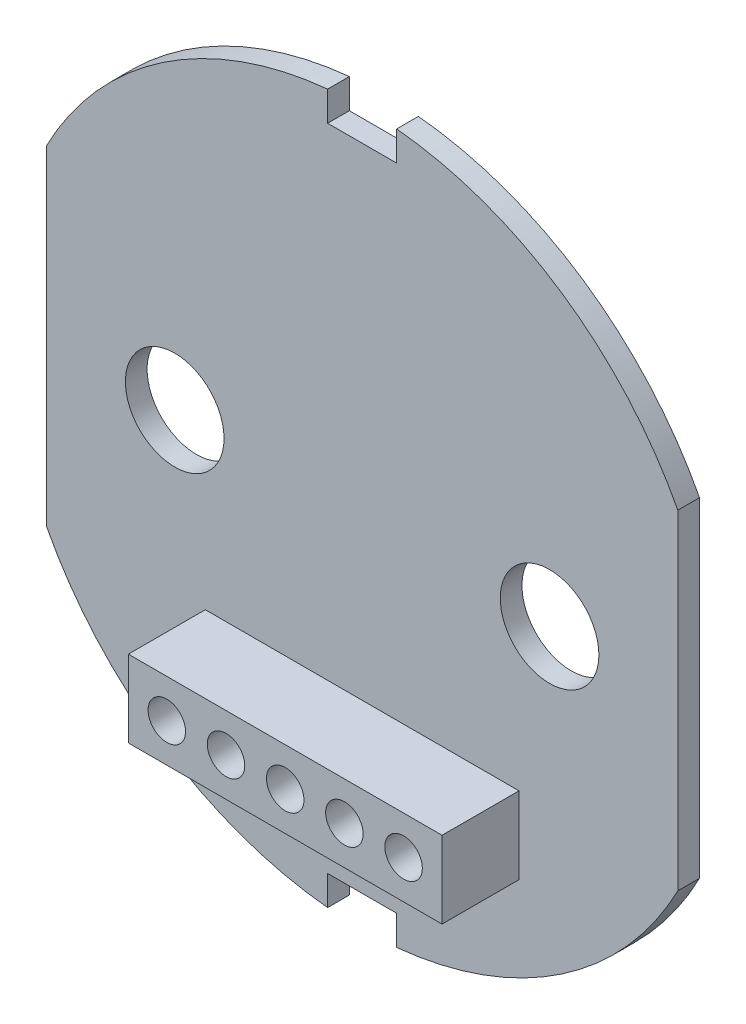
ISO-10303-21;
HEADER;
FILE_DESCRIPTION(('STEP AP214'),'2;1');
FILE_NAME('part.step','',(''),(''),'','','');
FILE_SCHEMA(('AUTOMOTIVE_DESIGN { 1 0 10303 214 1 1 1 1 }'));
ENDSEC;
DATA;
#1=APPLICATION_CONTEXT('core data for automotive mechanical design processes');
#2=APPLICATION_PROTOCOL_DEFINITION('international standard','automotive_design',2000,#1);
#3=PRODUCT_CONTEXT('',#1,'mechanical');
#4=PRODUCT('Part','Part','',(#3));
#5=PRODUCT_RELATED_PRODUCT_CATEGORY('part','',(#4));
#6=PRODUCT_DEFINITION_FORMATION('','',#4);
#7=PRODUCT_DEFINITION_CONTEXT('part definition',#1,'design');
#8=PRODUCT_DEFINITION('design','',#6,#7);
#9=PRODUCT_DEFINITION_SHAPE('','',#8);
#10=(LENGTH_UNIT() NAMED_UNIT(*) SI_UNIT(.MILLI.,.METRE.));
#11=(NAMED_UNIT(*) PLANE_ANGLE_UNIT() SI_UNIT($,.RADIAN.));
#12=(NAMED_UNIT(*) SI_UNIT($,.STERADIAN.) SOLID_ANGLE_UNIT());
#13=UNCERTAINTY_MEASURE_WITH_UNIT(LENGTH_MEASURE(1.E-05),#10,'distance_accuracy_value','');
#14=(GEOMETRIC_REPRESENTATION_CONTEXT(3) GLOBAL_UNCERTAINTY_ASSIGNED_CONTEXT((#13)) GLOBAL_UNIT_ASSIGNED_CONTEXT((#10,
#11,#12)) REPRESENTATION_CONTEXT('',''));
#15=CARTESIAN_POINT('',(0.,0.,0.));
#16=DIRECTION('',(0.,0.,1.));
#17=DIRECTION('',(1.,0.,0.));
#18=AXIS2_PLACEMENT_3D('',#15,#16,#17);
#19=CARTESIAN_POINT('',(0.,0.,1.1));
#20=DIRECTION('',(0.,0.,1.));
#21=DIRECTION('',(1.,0.,0.));
#22=AXIS2_PLACEMENT_3D('',#19,#20,#21);
#23=PLANE('',#22);
#24=DIRECTION('',(0.,-1.,0.));
#25=VECTOR('',#24,1.);
#26=CARTESIAN_POINT('',(-1.75,0.,1.1));
#27=LINE('',#26,#25);
#28=CARTESIAN_POINT('',(-1.75,17.9649659058958,1.1));
#29=VERTEX_POINT('',#28);
#30=CARTESIAN_POINT('',(-1.75,16.4649659058958,1.1));
#31=VERTEX_POINT('',#30);
#32=EDGE_CURVE('E309',#29,#31,#27,.T.);
#33=ORIENTED_EDGE('',*,*,#32,.F.);
#34=CARTESIAN_POINT('',(0.,0.,1.1));
#35=DIRECTION('',(0.,0.,1.));
#36=DIRECTION('',(1.,0.,0.));
#37=AXIS2_PLACEMENT_3D('',#34,#35,#36);
#38=CIRCLE('',#37,18.05);
#39=CARTESIAN_POINT('',(-16.,8.3547890458108,1.1));
#40=VERTEX_POINT('',#39);
#41=EDGE_CURVE('E311',#29,#40,#38,.T.);
#42=ORIENTED_EDGE('',*,*,#41,.T.);
#43=DIRECTION('',(0.,-1.,0.));
#44=VECTOR('',#43,1.);
#45=CARTESIAN_POINT('',(-16.,0.,1.1));
#46=LINE('',#45,#44);
#47=CARTESIAN_POINT('',(-16.,-8.35478904581079,1.1));
#48=VERTEX_POINT('',#47);
#49=EDGE_CURVE('E188',#40,#48,#46,.T.);
#50=ORIENTED_EDGE('',*,*,#49,.T.);
#51=CARTESIAN_POINT('',(0.,0.,1.1));
#52=DIRECTION('',(0.,0.,1.));
#53=DIRECTION('',(1.,0.,0.));
#54=AXIS2_PLACEMENT_3D('',#51,#52,#53);
#55=CIRCLE('',#54,18.05);
#56=CARTESIAN_POINT('',(-1.75,-17.9649659058958,1.1));
#57=VERTEX_POINT('',#56);
#58=EDGE_CURVE('E314',#48,#57,#55,.T.);
#59=ORIENTED_EDGE('',*,*,#58,.T.);
#60=DIRECTION('',(0.,1.,0.));
#61=VECTOR('',#60,1.);
#62=CARTESIAN_POINT('',(-1.75,0.,1.1));
#63=LINE('',#62,#61);
#64=CARTESIAN_POINT('',(-1.75,-16.4649659058958,1.1));
#65=VERTEX_POINT('',#64);
#66=EDGE_CURVE('E317',#57,#65,#63,.T.);
#67=ORIENTED_EDGE('',*,*,#66,.T.);
#68=DIRECTION('',(1.,0.,0.));
#69=VECTOR('',#68,1.);
#70=CARTESIAN_POINT('',(0.,-16.4649659058958,1.1));
#71=LINE('',#70,#69);
#72=CARTESIAN_POINT('',(1.75,-16.4649659058958,1.1));
#73=VERTEX_POINT('',#72);
#74=EDGE_CURVE('E320',#65,#73,#71,.T.);
#75=ORIENTED_EDGE('',*,*,#74,.T.);
#76=DIRECTION('',(0.,1.,0.));
#77=VECTOR('',#76,1.);
#78=CARTESIAN_POINT('',(1.75,0.,1.1));
#79=LINE('',#78,#77);
#80=CARTESIAN_POINT('',(1.75,-17.9649659058958,1.1));
#81=VERTEX_POINT('',#80);
#82=EDGE_CURVE('E322',#81,#73,#79,.T.);
#83=ORIENTED_EDGE('',*,*,#82,.F.);
#84=CARTESIAN_POINT('',(0.,0.,1.1));
#85=DIRECTION('',(0.,0.,1.));
#86=DIRECTION('',(1.,0.,0.));
#87=AXIS2_PLACEMENT_3D('',#84,#85,#86);
#88=CIRCLE('',#87,18.05);
#89=CARTESIAN_POINT('',(16.,-8.35478904581079,1.1));
#90=VERTEX_POINT('',#89);
#91=EDGE_CURVE('E325',#81,#90,#88,.T.);
#92=ORIENTED_EDGE('',*,*,#91,.T.);
#93=DIRECTION('',(0.,-1.,0.));
#94=VECTOR('',#93,1.);
#95=CARTESIAN_POINT('',(16.,0.,1.1));
#96=LINE('',#95,#94);
#97=CARTESIAN_POINT('',(16.,8.35478904581079,1.1));
#98=VERTEX_POINT('',#97);
#99=EDGE_CURVE('E153',#98,#90,#96,.T.);
#100=ORIENTED_EDGE('',*,*,#99,.F.);
#101=CARTESIAN_POINT('',(0.,0.,1.1));
#102=DIRECTION('',(0.,0.,1.));
#103=DIRECTION('',(1.,0.,0.));
#104=AXIS2_PLACEMENT_3D('',#101,#102,#103);
#105=CIRCLE('',#104,18.05);
#106=CARTESIAN_POINT('',(1.75,17.9649659058958,1.1));
#107=VERTEX_POINT('',#106);
#108=EDGE_CURVE('E146',#98,#107,#105,.T.);
#109=ORIENTED_EDGE('',*,*,#108,.T.);
#110=DIRECTION('',(0.,-1.,0.));
#111=VECTOR('',#110,1.);
#112=CARTESIAN_POINT('',(1.75,0.,1.1));
#113=LINE('',#112,#111);
#114=CARTESIAN_POINT('',(1.75,16.4649659058958,1.1));
#115=VERTEX_POINT('',#114);
#116=EDGE_CURVE('E135',#107,#115,#113,.T.);
#117=ORIENTED_EDGE('',*,*,#116,.T.);
#118=DIRECTION('',(1.,0.,0.));
#119=VECTOR('',#118,1.);
#120=CARTESIAN_POINT('',(0.,16.4649659058958,1.1));
#121=LINE('',#120,#119);
#122=EDGE_CURVE('E145',#31,#115,#121,.T.);
#123=ORIENTED_EDGE('',*,*,#122,.F.);
#124=EDGE_LOOP('',(#33,#42,#50,#59,#67,#75,#83,#92,#100,#109,#117,#123));
#125=FACE_BOUND('',#124,.T.);
#126=CARTESIAN_POINT('',(-9.5,0.,1.1));
#127=DIRECTION('',(0.,0.,1.));
#128=DIRECTION('',(1.,0.,0.));
#129=AXIS2_PLACEMENT_3D('',#126,#127,#128);
#130=CIRCLE('',#129,2.5);
#131=CARTESIAN_POINT('',(-7.,0.,1.1));
#132=VERTEX_POINT('',#131);
#133=EDGE_CURVE('E306',#132,#132,#130,.T.);
#134=ORIENTED_EDGE('',*,*,#133,.F.);
#135=EDGE_LOOP('',(#134));
#136=FACE_BOUND('',#135,.T.);
#137=CARTESIAN_POINT('',(9.5,0.,1.1));
#138=DIRECTION('',(0.,0.,1.));
#139=DIRECTION('',(1.,0.,0.));
#140=AXIS2_PLACEMENT_3D('',#137,#138,#139);
#141=CIRCLE('',#140,2.5);
#142=CARTESIAN_POINT('',(12.,0.,1.1));
#143=VERTEX_POINT('',#142);
#144=EDGE_CURVE('E225',#143,#143,#141,.T.);
#145=ORIENTED_EDGE('',*,*,#144,.F.);
#146=EDGE_LOOP('',(#145));
#147=FACE_BOUND('',#146,.T.);
#148=DIRECTION('',(1.,0.,0.));
#149=VECTOR('',#148,1.);
#150=CARTESIAN_POINT('',(-7.95,-11.8890796058138,1.1));
#151=LINE('',#150,#149);
#152=CARTESIAN_POINT('',(-7.95,-11.8890796058138,1.1));
#153=VERTEX_POINT('',#152);
#154=CARTESIAN_POINT('',(7.95,-11.8890796058138,1.1));
#155=VERTEX_POINT('',#154);
#156=EDGE_CURVE('E290',#153,#155,#151,.T.);
#157=ORIENTED_EDGE('',*,*,#156,.F.);
#158=DIRECTION('',(0.,-1.,0.));
#159=VECTOR('',#158,1.);
#160=CARTESIAN_POINT('',(-7.95,-7.98907960581377,1.1));
#161=LINE('',#160,#159);
#162=CARTESIAN_POINT('',(-7.95,-7.98907960581377,1.1));
#163=VERTEX_POINT('',#162);
#164=EDGE_CURVE('E273',#163,#153,#161,.T.);
#165=ORIENTED_EDGE('',*,*,#164,.F.);
#166=DIRECTION('',(-1.,0.,0.));
#167=VECTOR('',#166,1.);
#168=CARTESIAN_POINT('',(-7.95,-7.98907960581377,1.1));
#169=LINE('',#168,#167);
#170=CARTESIAN_POINT('',(7.95,-7.98907960581377,1.1));
#171=VERTEX_POINT('',#170);
#172=EDGE_CURVE('E278',#171,#163,#169,.T.);
#173=ORIENTED_EDGE('',*,*,#172,.F.);
#174=DIRECTION('',(0.,1.,0.));
#175=VECTOR('',#174,1.);
#176=CARTESIAN_POINT('',(7.95,-7.98907960581377,1.1));
#177=LINE('',#176,#175);
#178=EDGE_CURVE('E293',#155,#171,#177,.T.);
#179=ORIENTED_EDGE('',*,*,#178,.F.);
#180=EDGE_LOOP('',(#157,#165,#173,#179));
#181=FACE_BOUND('',#180,.T.);
#182=ADVANCED_FACE('F33',(#125,#136,#147,#181),#23,.T.);
#183=CARTESIAN_POINT('',(-1.75,0.,1.1));
#184=DIRECTION('',(1.,0.,0.));
#185=DIRECTION('',(0.,1.,0.));
#186=AXIS2_PLACEMENT_3D('',#183,#184,#185);
#187=PLANE('',#186);
#188=DIRECTION('',(0.,-1.,0.));
#189=VECTOR('',#188,1.);
#190=CARTESIAN_POINT('',(-1.75,0.,0.));
#191=LINE('',#190,#189);
#192=CARTESIAN_POINT('',(-1.75,17.9649659058958,0.));
#193=VERTEX_POINT('',#192);
#194=CARTESIAN_POINT('',(-1.75,16.4649659058958,0.));
#195=VERTEX_POINT('',#194);
#196=EDGE_CURVE('E195',#193,#195,#191,.T.);
#197=ORIENTED_EDGE('',*,*,#196,.F.);
#198=DIRECTION('',(0.,0.,-1.));
#199=VECTOR('',#198,1.);
#200=CARTESIAN_POINT('',(-1.75,17.9649659058958,1.1));
#201=LINE('',#200,#199);
#202=EDGE_CURVE('E11',#29,#193,#201,.T.);
#203=ORIENTED_EDGE('',*,*,#202,.F.);
#204=ORIENTED_EDGE('',*,*,#32,.T.);
#205=DIRECTION('',(0.,0.,-1.));
#206=VECTOR('',#205,1.);
#207=CARTESIAN_POINT('',(-1.75,16.4649659058958,1.1));
#208=LINE('',#207,#206);
#209=EDGE_CURVE('E57',#31,#195,#208,.T.);
#210=ORIENTED_EDGE('',*,*,#209,.T.);
#211=EDGE_LOOP('',(#197,#203,#204,#210));
#212=FACE_BOUND('',#211,.T.);
#213=ADVANCED_FACE('F346',(#212),#187,.T.);
#214=CARTESIAN_POINT('',(0.,0.,1.1));
#215=DIRECTION('',(0.,0.,-1.));
#216=DIRECTION('',(-1.,0.,0.));
#217=AXIS2_PLACEMENT_3D('',#214,#215,#216);
#218=CYLINDRICAL_SURFACE('',#217,18.05);
#219=CARTESIAN_POINT('',(0.,0.,0.));
#220=DIRECTION('',(0.,0.,1.));
#221=DIRECTION('',(1.,0.,0.));
#222=AXIS2_PLACEMENT_3D('',#219,#220,#221);
#223=CIRCLE('',#222,18.05);
#224=CARTESIAN_POINT('',(-16.,8.3547890458108,0.));
#225=VERTEX_POINT('',#224);
#226=EDGE_CURVE('E192',#193,#225,#223,.T.);
#227=ORIENTED_EDGE('',*,*,#226,.T.);
#228=DIRECTION('',(0.,0.,-1.));
#229=VECTOR('',#228,1.);
#230=CARTESIAN_POINT('',(-16.,8.3547890458108,1.1));
#231=LINE('',#230,#229);
#232=EDGE_CURVE('E41',#40,#225,#231,.T.);
#233=ORIENTED_EDGE('',*,*,#232,.F.);
#234=ORIENTED_EDGE('',*,*,#41,.F.);
#235=ORIENTED_EDGE('',*,*,#202,.T.);
#236=EDGE_LOOP('',(#227,#233,#234,#235));
#237=FACE_BOUND('',#236,.T.);
#238=ADVANCED_FACE('F193',(#237),#218,.T.);
#239=CARTESIAN_POINT('',(-16.,0.,1.1));
#240=DIRECTION('',(1.,0.,0.));
#241=DIRECTION('',(0.,0.,-1.));
#242=AXIS2_PLACEMENT_3D('',#239,#240,#241);
#243=PLANE('',#242);
#244=DIRECTION('',(0.,-1.,0.));
#245=VECTOR('',#244,1.);
#246=CARTESIAN_POINT('',(-16.,0.,0.));
#247=LINE('',#246,#245);
#248=CARTESIAN_POINT('',(-16.,-8.35478904581079,0.));
#249=VERTEX_POINT('',#248);
#250=EDGE_CURVE('E186',#225,#249,#247,.T.);
#251=ORIENTED_EDGE('',*,*,#250,.T.);
#252=DIRECTION('',(0.,0.,-1.));
#253=VECTOR('',#252,1.);
#254=CARTESIAN_POINT('',(-16.,-8.35478904581079,1.1));
#255=LINE('',#254,#253);
#256=EDGE_CURVE('E177',#48,#249,#255,.T.);
#257=ORIENTED_EDGE('',*,*,#256,.F.);
#258=ORIENTED_EDGE('',*,*,#49,.F.);
#259=ORIENTED_EDGE('',*,*,#232,.T.);
#260=EDGE_LOOP('',(#251,#257,#258,#259));
#261=FACE_BOUND('',#260,.T.);
#262=ADVANCED_FACE('F184',(#261),#243,.F.);
#263=CARTESIAN_POINT('',(0.,0.,1.1));
#264=DIRECTION('',(0.,0.,-1.));
#265=DIRECTION('',(-1.,0.,0.));
#266=AXIS2_PLACEMENT_3D('',#263,#264,#265);
#267=CYLINDRICAL_SURFACE('',#266,18.05);
#268=CARTESIAN_POINT('',(0.,0.,0.));
#269=DIRECTION('',(0.,0.,1.));
#270=DIRECTION('',(1.,0.,0.));
#271=AXIS2_PLACEMENT_3D('',#268,#269,#270);
#272=CIRCLE('',#271,18.05);
#273=CARTESIAN_POINT('',(-1.75,-17.9649659058958,0.));
#274=VERTEX_POINT('',#273);
#275=EDGE_CURVE('E197',#249,#274,#272,.T.);
#276=ORIENTED_EDGE('',*,*,#275,.T.);
#277=DIRECTION('',(0.,0.,-1.));
#278=VECTOR('',#277,1.);
#279=CARTESIAN_POINT('',(-1.75,-17.9649659058958,1.1));
#280=LINE('',#279,#278);
#281=EDGE_CURVE('E174',#57,#274,#280,.T.);
#282=ORIENTED_EDGE('',*,*,#281,.F.);
#283=ORIENTED_EDGE('',*,*,#58,.F.);
#284=ORIENTED_EDGE('',*,*,#256,.T.);
#285=EDGE_LOOP('',(#276,#282,#283,#284));
#286=FACE_BOUND('',#285,.T.);
#287=ADVANCED_FACE('F426',(#286),#267,.T.);
#288=CARTESIAN_POINT('',(-1.75,0.,1.1));
#289=DIRECTION('',(-1.,0.,0.));
#290=DIRECTION('',(0.,-1.,0.));
#291=AXIS2_PLACEMENT_3D('',#288,#289,#290);
#292=PLANE('',#291);
#293=DIRECTION('',(0.,1.,0.));
#294=VECTOR('',#293,1.);
#295=CARTESIAN_POINT('',(-1.75,0.,0.));
#296=LINE('',#295,#294);
#297=CARTESIAN_POINT('',(-1.75,-16.4649659058958,0.));
#298=VERTEX_POINT('',#297);
#299=EDGE_CURVE('E205',#274,#298,#296,.T.);
#300=ORIENTED_EDGE('',*,*,#299,.T.);
#301=DIRECTION('',(0.,0.,-1.));
#302=VECTOR('',#301,1.);
#303=CARTESIAN_POINT('',(-1.75,-16.4649659058958,1.1));
#304=LINE('',#303,#302);
#305=EDGE_CURVE('E171',#65,#298,#304,.T.);
#306=ORIENTED_EDGE('',*,*,#305,.F.);
#307=ORIENTED_EDGE('',*,*,#66,.F.);
#308=ORIENTED_EDGE('',*,*,#281,.T.);
#309=EDGE_LOOP('',(#300,#306,#307,#308));
#310=FACE_BOUND('',#309,.T.);
#311=ADVANCED_FACE('F429',(#310),#292,.F.);
#312=CARTESIAN_POINT('',(0.,-16.4649659058958,1.1));
#313=DIRECTION('',(0.,1.,0.));
#314=DIRECTION('',(0.,0.,1.));
#315=AXIS2_PLACEMENT_3D('',#312,#313,#314);
#316=PLANE('',#315);
#317=DIRECTION('',(1.,0.,0.));
#318=VECTOR('',#317,1.);
#319=CARTESIAN_POINT('',(0.,-16.4649659058958,0.));
#320=LINE('',#319,#318);
#321=CARTESIAN_POINT('',(1.75,-16.4649659058958,0.));
#322=VERTEX_POINT('',#321);
#323=EDGE_CURVE('E208',#298,#322,#320,.T.);
#324=ORIENTED_EDGE('',*,*,#323,.T.);
#325=DIRECTION('',(0.,0.,-1.));
#326=VECTOR('',#325,1.);
#327=CARTESIAN_POINT('',(1.75,-16.4649659058958,1.1));
#328=LINE('',#327,#326);
#329=EDGE_CURVE('E169',#73,#322,#328,.T.);
#330=ORIENTED_EDGE('',*,*,#329,.F.);
#331=ORIENTED_EDGE('',*,*,#74,.F.);
#332=ORIENTED_EDGE('',*,*,#305,.T.);
#333=EDGE_LOOP('',(#324,#330,#331,#332));
#334=FACE_BOUND('',#333,.T.);
#335=ADVANCED_FACE('F433',(#334),#316,.F.);
#336=CARTESIAN_POINT('',(1.75,0.,1.1));
#337=DIRECTION('',(-1.,0.,0.));
#338=DIRECTION('',(0.,-1.,0.));
#339=AXIS2_PLACEMENT_3D('',#336,#337,#338);
#340=PLANE('',#339);
#341=DIRECTION('',(0.,1.,0.));
#342=VECTOR('',#341,1.);
#343=CARTESIAN_POINT('',(1.75,0.,0.));
#344=LINE('',#343,#342);
#345=CARTESIAN_POINT('',(1.75,-17.9649659058958,0.));
#346=VERTEX_POINT('',#345);
#347=EDGE_CURVE('E211',#346,#322,#344,.T.);
#348=ORIENTED_EDGE('',*,*,#347,.F.);
#349=DIRECTION('',(0.,0.,-1.));
#350=VECTOR('',#349,1.);
#351=CARTESIAN_POINT('',(1.75,-17.9649659058958,1.1));
#352=LINE('',#351,#350);
#353=EDGE_CURVE('E167',#81,#346,#352,.T.);
#354=ORIENTED_EDGE('',*,*,#353,.F.);
#355=ORIENTED_EDGE('',*,*,#82,.T.);
#356=ORIENTED_EDGE('',*,*,#329,.T.);
#357=EDGE_LOOP('',(#348,#354,#355,#356));
#358=FACE_BOUND('',#357,.T.);
#359=ADVANCED_FACE('F437',(#358),#340,.T.);
#360=CARTESIAN_POINT('',(0.,0.,1.1));
#361=DIRECTION('',(0.,0.,-1.));
#362=DIRECTION('',(-1.,0.,0.));
#363=AXIS2_PLACEMENT_3D('',#360,#361,#362);
#364=CYLINDRICAL_SURFACE('',#363,18.05);
#365=CARTESIAN_POINT('',(0.,0.,0.));
#366=DIRECTION('',(0.,0.,1.));
#367=DIRECTION('',(1.,0.,0.));
#368=AXIS2_PLACEMENT_3D('',#365,#366,#367);
#369=CIRCLE('',#368,18.05);
#370=CARTESIAN_POINT('',(16.,-8.35478904581079,0.));
#371=VERTEX_POINT('',#370);
#372=EDGE_CURVE('E214',#346,#371,#369,.T.);
#373=ORIENTED_EDGE('',*,*,#372,.T.);
#374=DIRECTION('',(0.,0.,-1.));
#375=VECTOR('',#374,1.);
#376=CARTESIAN_POINT('',(16.,-8.35478904581079,1.1));
#377=LINE('',#376,#375);
#378=EDGE_CURVE('E161',#90,#371,#377,.T.);
#379=ORIENTED_EDGE('',*,*,#378,.F.);
#380=ORIENTED_EDGE('',*,*,#91,.F.);
#381=ORIENTED_EDGE('',*,*,#353,.T.);
#382=EDGE_LOOP('',(#373,#379,#380,#381));
#383=FACE_BOUND('',#382,.T.);
#384=ADVANCED_FACE('F441',(#383),#364,.T.);
#385=CARTESIAN_POINT('',(16.,0.,1.1));
#386=DIRECTION('',(1.,0.,0.));
#387=DIRECTION('',(0.,0.,-1.));
#388=AXIS2_PLACEMENT_3D('',#385,#386,#387);
#389=PLANE('',#388);
#390=DIRECTION('',(0.,-1.,0.));
#391=VECTOR('',#390,1.);
#392=CARTESIAN_POINT('',(16.,0.,0.));
#393=LINE('',#392,#391);
#394=CARTESIAN_POINT('',(16.,8.35478904581079,0.));
#395=VERTEX_POINT('',#394);
#396=EDGE_CURVE('E217',#395,#371,#393,.T.);
#397=ORIENTED_EDGE('',*,*,#396,.F.);
#398=DIRECTION('',(0.,0.,-1.));
#399=VECTOR('',#398,1.);
#400=CARTESIAN_POINT('',(16.,8.35478904581079,1.1));
#401=LINE('',#400,#399);
#402=EDGE_CURVE('E159',#98,#395,#401,.T.);
#403=ORIENTED_EDGE('',*,*,#402,.F.);
#404=ORIENTED_EDGE('',*,*,#99,.T.);
#405=ORIENTED_EDGE('',*,*,#378,.T.);
#406=EDGE_LOOP('',(#397,#403,#404,#405));
#407=FACE_BOUND('',#406,.T.);
#408=ADVANCED_FACE('F329',(#407),#389,.T.);
#409=CARTESIAN_POINT('',(0.,0.,1.1));
#410=DIRECTION('',(0.,0.,-1.));
#411=DIRECTION('',(-1.,0.,0.));
#412=AXIS2_PLACEMENT_3D('',#409,#410,#411);
#413=CYLINDRICAL_SURFACE('',#412,18.05);
#414=CARTESIAN_POINT('',(0.,0.,0.));
#415=DIRECTION('',(0.,0.,1.));
#416=DIRECTION('',(1.,0.,0.));
#417=AXIS2_PLACEMENT_3D('',#414,#415,#416);
#418=CIRCLE('',#417,18.05);
#419=CARTESIAN_POINT('',(1.75,17.9649659058958,0.));
#420=VERTEX_POINT('',#419);
#421=EDGE_CURVE('E158',#395,#420,#418,.T.);
#422=ORIENTED_EDGE('',*,*,#421,.T.);
#423=DIRECTION('',(0.,0.,-1.));
#424=VECTOR('',#423,1.);
#425=CARTESIAN_POINT('',(1.75,17.9649659058958,1.1));
#426=LINE('',#425,#424);
#427=EDGE_CURVE('E140',#107,#420,#426,.T.);
#428=ORIENTED_EDGE('',*,*,#427,.F.);
#429=ORIENTED_EDGE('',*,*,#108,.F.);
#430=ORIENTED_EDGE('',*,*,#402,.T.);
#431=EDGE_LOOP('',(#422,#428,#429,#430));
#432=FACE_BOUND('',#431,.T.);
#433=ADVANCED_FACE('F156',(#432),#413,.T.);
#434=CARTESIAN_POINT('',(1.75,0.,1.1));
#435=DIRECTION('',(1.,0.,0.));
#436=DIRECTION('',(0.,1.,0.));
#437=AXIS2_PLACEMENT_3D('',#434,#435,#436);
#438=PLANE('',#437);
#439=DIRECTION('',(0.,-1.,0.));
#440=VECTOR('',#439,1.);
#441=CARTESIAN_POINT('',(1.75,0.,0.));
#442=LINE('',#441,#440);
#443=CARTESIAN_POINT('',(1.75,16.4649659058958,0.));
#444=VERTEX_POINT('',#443);
#445=EDGE_CURVE('E221',#420,#444,#442,.T.);
#446=ORIENTED_EDGE('',*,*,#445,.T.);
#447=DIRECTION('',(0.,0.,-1.));
#448=VECTOR('',#447,1.);
#449=CARTESIAN_POINT('',(1.75,16.4649659058958,1.1));
#450=LINE('',#449,#448);
#451=EDGE_CURVE('E142',#115,#444,#450,.T.);
#452=ORIENTED_EDGE('',*,*,#451,.F.);
#453=ORIENTED_EDGE('',*,*,#116,.F.);
#454=ORIENTED_EDGE('',*,*,#427,.T.);
#455=EDGE_LOOP('',(#446,#452,#453,#454));
#456=FACE_BOUND('',#455,.T.);
#457=ADVANCED_FACE('F138',(#456),#438,.F.);
#458=CARTESIAN_POINT('',(0.,-9.93907960581373,1.1));
#459=DIRECTION('',(0.,0.,-1.));
#460=DIRECTION('',(-1.,0.,0.));
#461=AXIS2_PLACEMENT_3D('',#458,#459,#460);
#462=CYLINDRICAL_SURFACE('',#461,0.95);
#463=CARTESIAN_POINT('',(0.,-9.93907960581373,0.));
#464=DIRECTION('',(0.,0.,1.));
#465=DIRECTION('',(1.,0.,0.));
#466=AXIS2_PLACEMENT_3D('',#463,#464,#465);
#467=CIRCLE('',#466,0.95);
#468=CARTESIAN_POINT('',(0.95,-9.93907960581373,0.));
#469=VERTEX_POINT('',#468);
#470=EDGE_CURVE('E199',#469,#469,#467,.T.);
#471=ORIENTED_EDGE('',*,*,#470,.F.);
#472=EDGE_LOOP('',(#471));
#473=FACE_BOUND('',#472,.T.);
#474=CARTESIAN_POINT('',(0.,-9.93907960581373,5.));
#475=DIRECTION('',(0.,0.,1.));
#476=DIRECTION('',(1.,0.,0.));
#477=AXIS2_PLACEMENT_3D('',#474,#475,#476);
#478=CIRCLE('',#477,0.95);
#479=CARTESIAN_POINT('',(0.95,-9.93907960581373,5.));
#480=VERTEX_POINT('',#479);
#481=EDGE_CURVE('E258',#480,#480,#478,.T.);
#482=ORIENTED_EDGE('',*,*,#481,.T.);
#483=EDGE_LOOP('',(#482));
#484=FACE_BOUND('',#483,.T.);
#485=ADVANCED_FACE('F251',(#473,#484),#462,.F.);
#486=CARTESIAN_POINT('',(3.,-9.93907960581373,1.1));
#487=DIRECTION('',(0.,0.,-1.));
#488=DIRECTION('',(-1.,0.,0.));
#489=AXIS2_PLACEMENT_3D('',#486,#487,#488);
#490=CYLINDRICAL_SURFACE('',#489,0.95);
#491=CARTESIAN_POINT('',(3.,-9.93907960581373,0.));
#492=DIRECTION('',(0.,0.,1.));
#493=DIRECTION('',(1.,0.,0.));
#494=AXIS2_PLACEMENT_3D('',#491,#492,#493);
#495=CIRCLE('',#494,0.95);
#496=CARTESIAN_POINT('',(3.95,-9.93907960581373,0.));
#497=VERTEX_POINT('',#496);
#498=EDGE_CURVE('E244',#497,#497,#495,.T.);
#499=ORIENTED_EDGE('',*,*,#498,.F.);
#500=EDGE_LOOP('',(#499));
#501=FACE_BOUND('',#500,.T.);
#502=CARTESIAN_POINT('',(3.,-9.93907960581373,5.));
#503=DIRECTION('',(0.,0.,1.));
#504=DIRECTION('',(1.,0.,0.));
#505=AXIS2_PLACEMENT_3D('',#502,#503,#504);
#506=CIRCLE('',#505,0.95);
#507=CARTESIAN_POINT('',(3.95,-9.93907960581373,5.));
#508=VERTEX_POINT('',#507);
#509=EDGE_CURVE('E260',#508,#508,#506,.T.);
#510=ORIENTED_EDGE('',*,*,#509,.T.);
#511=EDGE_LOOP('',(#510));
#512=FACE_BOUND('',#511,.T.);
#513=ADVANCED_FACE('F254',(#501,#512),#490,.F.);
#514=CARTESIAN_POINT('',(6.,-9.93907960581373,1.1));
#515=DIRECTION('',(0.,0.,-1.));
#516=DIRECTION('',(-1.,0.,0.));
#517=AXIS2_PLACEMENT_3D('',#514,#515,#516);
#518=CYLINDRICAL_SURFACE('',#517,0.95);
#519=CARTESIAN_POINT('',(6.,-9.93907960581373,0.));
#520=DIRECTION('',(0.,0.,1.));
#521=DIRECTION('',(1.,0.,0.));
#522=AXIS2_PLACEMENT_3D('',#519,#520,#521);
#523=CIRCLE('',#522,0.95);
#524=CARTESIAN_POINT('',(6.95,-9.93907960581373,0.));
#525=VERTEX_POINT('',#524);
#526=EDGE_CURVE('E241',#525,#525,#523,.T.);
#527=ORIENTED_EDGE('',*,*,#526,.F.);
#528=EDGE_LOOP('',(#527));
#529=FACE_BOUND('',#528,.T.);
#530=CARTESIAN_POINT('',(6.,-9.93907960581373,5.));
#531=DIRECTION('',(0.,0.,1.));
#532=DIRECTION('',(1.,0.,0.));
#533=AXIS2_PLACEMENT_3D('',#530,#531,#532);
#534=CIRCLE('',#533,0.949999999999999);
#535=CARTESIAN_POINT('',(6.95,-9.93907960581373,5.));
#536=VERTEX_POINT('',#535);
#537=EDGE_CURVE('E261',#536,#536,#534,.T.);
#538=ORIENTED_EDGE('',*,*,#537,.T.);
#539=EDGE_LOOP('',(#538));
#540=FACE_BOUND('',#539,.T.);
#541=ADVANCED_FACE('F388',(#529,#540),#518,.F.);
#542=CARTESIAN_POINT('',(-3.,-9.93907960581375,1.1));
#543=DIRECTION('',(0.,0.,-1.));
#544=DIRECTION('',(-1.,0.,0.));
#545=AXIS2_PLACEMENT_3D('',#542,#543,#544);
#546=CYLINDRICAL_SURFACE('',#545,0.95);
#547=CARTESIAN_POINT('',(-3.,-9.93907960581375,0.));
#548=DIRECTION('',(0.,0.,1.));
#549=DIRECTION('',(1.,0.,0.));
#550=AXIS2_PLACEMENT_3D('',#547,#548,#549);
#551=CIRCLE('',#550,0.95);
#552=CARTESIAN_POINT('',(-2.05,-9.93907960581375,0.));
#553=VERTEX_POINT('',#552);
#554=EDGE_CURVE('E238',#553,#553,#551,.T.);
#555=ORIENTED_EDGE('',*,*,#554,.F.);
#556=EDGE_LOOP('',(#555));
#557=FACE_BOUND('',#556,.T.);
#558=CARTESIAN_POINT('',(-3.,-9.93907960581375,5.));
#559=DIRECTION('',(0.,0.,1.));
#560=DIRECTION('',(1.,0.,0.));
#561=AXIS2_PLACEMENT_3D('',#558,#559,#560);
#562=CIRCLE('',#561,0.95);
#563=CARTESIAN_POINT('',(-2.05,-9.93907960581375,5.));
#564=VERTEX_POINT('',#563);
#565=EDGE_CURVE('E267',#564,#564,#562,.T.);
#566=ORIENTED_EDGE('',*,*,#565,.T.);
#567=EDGE_LOOP('',(#566));
#568=FACE_BOUND('',#567,.T.);
#569=ADVANCED_FACE('F385',(#557,#568),#546,.F.);
#570=CARTESIAN_POINT('',(-6.,-9.93907960581377,1.1));
#571=DIRECTION('',(0.,0.,-1.));
#572=DIRECTION('',(-1.,0.,0.));
#573=AXIS2_PLACEMENT_3D('',#570,#571,#572);
#574=CYLINDRICAL_SURFACE('',#573,0.95);
#575=CARTESIAN_POINT('',(-6.,-9.93907960581377,0.));
#576=DIRECTION('',(0.,0.,1.));
#577=DIRECTION('',(1.,0.,0.));
#578=AXIS2_PLACEMENT_3D('',#575,#576,#577);
#579=CIRCLE('',#578,0.95);
#580=CARTESIAN_POINT('',(-5.05,-9.93907960581377,0.));
#581=VERTEX_POINT('',#580);
#582=EDGE_CURVE('E235',#581,#581,#579,.T.);
#583=ORIENTED_EDGE('',*,*,#582,.F.);
#584=EDGE_LOOP('',(#583));
#585=FACE_BOUND('',#584,.T.);
#586=CARTESIAN_POINT('',(-6.,-9.93907960581377,5.));
#587=DIRECTION('',(0.,0.,1.));
#588=DIRECTION('',(1.,0.,0.));
#589=AXIS2_PLACEMENT_3D('',#586,#587,#588);
#590=CIRCLE('',#589,0.95);
#591=CARTESIAN_POINT('',(-5.05,-9.93907960581377,5.));
#592=VERTEX_POINT('',#591);
#593=EDGE_CURVE('E264',#592,#592,#590,.T.);
#594=ORIENTED_EDGE('',*,*,#593,.T.);
#595=EDGE_LOOP('',(#594));
#596=FACE_BOUND('',#595,.T.);
#597=ADVANCED_FACE('F387',(#585,#596),#574,.F.);
#598=CARTESIAN_POINT('',(-9.5,0.,1.1));
#599=DIRECTION('',(0.,0.,-1.));
#600=DIRECTION('',(-1.,0.,0.));
#601=AXIS2_PLACEMENT_3D('',#598,#599,#600);
#602=CYLINDRICAL_SURFACE('',#601,2.5);
#603=ORIENTED_EDGE('',*,*,#133,.T.);
#604=EDGE_LOOP('',(#603));
#605=FACE_BOUND('',#604,.T.);
#606=CARTESIAN_POINT('',(-9.5,0.,0.));
#607=DIRECTION('',(0.,0.,1.));
#608=DIRECTION('',(1.,0.,0.));
#609=AXIS2_PLACEMENT_3D('',#606,#607,#608);
#610=CIRCLE('',#609,2.5);
#611=CARTESIAN_POINT('',(-7.,0.,0.));
#612=VERTEX_POINT('',#611);
#613=EDGE_CURVE('E231',#612,#612,#610,.T.);
#614=ORIENTED_EDGE('',*,*,#613,.F.);
#615=EDGE_LOOP('',(#614));
#616=FACE_BOUND('',#615,.T.);
#617=ADVANCED_FACE('F342',(#605,#616),#602,.F.);
#618=CARTESIAN_POINT('',(9.5,0.,1.1));
#619=DIRECTION('',(0.,0.,-1.));
#620=DIRECTION('',(-1.,0.,0.));
#621=AXIS2_PLACEMENT_3D('',#618,#619,#620);
#622=CYLINDRICAL_SURFACE('',#621,2.5);
#623=ORIENTED_EDGE('',*,*,#144,.T.);
#624=EDGE_LOOP('',(#623));
#625=FACE_BOUND('',#624,.T.);
#626=CARTESIAN_POINT('',(9.5,0.,0.));
#627=DIRECTION('',(0.,0.,1.));
#628=DIRECTION('',(1.,0.,0.));
#629=AXIS2_PLACEMENT_3D('',#626,#627,#628);
#630=CIRCLE('',#629,2.5);
#631=CARTESIAN_POINT('',(12.,0.,0.));
#632=VERTEX_POINT('',#631);
#633=EDGE_CURVE('E228',#632,#632,#630,.T.);
#634=ORIENTED_EDGE('',*,*,#633,.F.);
#635=EDGE_LOOP('',(#634));
#636=FACE_BOUND('',#635,.T.);
#637=ADVANCED_FACE('F35',(#625,#636),#622,.F.);
#638=CARTESIAN_POINT('',(0.,16.4649659058958,1.1));
#639=DIRECTION('',(0.,1.,0.));
#640=DIRECTION('',(0.,0.,1.));
#641=AXIS2_PLACEMENT_3D('',#638,#639,#640);
#642=PLANE('',#641);
#643=DIRECTION('',(1.,0.,0.));
#644=VECTOR('',#643,1.);
#645=CARTESIAN_POINT('',(0.,16.4649659058958,0.));
#646=LINE('',#645,#644);
#647=EDGE_CURVE('E223',#195,#444,#646,.T.);
#648=ORIENTED_EDGE('',*,*,#647,.F.);
#649=ORIENTED_EDGE('',*,*,#209,.F.);
#650=ORIENTED_EDGE('',*,*,#122,.T.);
#651=ORIENTED_EDGE('',*,*,#451,.T.);
#652=EDGE_LOOP('',(#648,#649,#650,#651));
#653=FACE_BOUND('',#652,.T.);
#654=ADVANCED_FACE('F332',(#653),#642,.T.);
#655=CARTESIAN_POINT('',(0.,0.,0.));
#656=DIRECTION('',(0.,0.,1.));
#657=DIRECTION('',(1.,0.,0.));
#658=AXIS2_PLACEMENT_3D('',#655,#656,#657);
#659=PLANE('',#658);
#660=ORIENTED_EDGE('',*,*,#633,.T.);
#661=EDGE_LOOP('',(#660));
#662=FACE_BOUND('',#661,.T.);
#663=ORIENTED_EDGE('',*,*,#613,.T.);
#664=EDGE_LOOP('',(#663));
#665=FACE_BOUND('',#664,.T.);
#666=ORIENTED_EDGE('',*,*,#582,.T.);
#667=EDGE_LOOP('',(#666));
#668=FACE_BOUND('',#667,.T.);
#669=ORIENTED_EDGE('',*,*,#554,.T.);
#670=EDGE_LOOP('',(#669));
#671=FACE_BOUND('',#670,.T.);
#672=ORIENTED_EDGE('',*,*,#526,.T.);
#673=EDGE_LOOP('',(#672));
#674=FACE_BOUND('',#673,.T.);
#675=ORIENTED_EDGE('',*,*,#498,.T.);
#676=EDGE_LOOP('',(#675));
#677=FACE_BOUND('',#676,.T.);
#678=ORIENTED_EDGE('',*,*,#470,.T.);
#679=EDGE_LOOP('',(#678));
#680=FACE_BOUND('',#679,.T.);
#681=ORIENTED_EDGE('',*,*,#196,.T.);
#682=ORIENTED_EDGE('',*,*,#647,.T.);
#683=ORIENTED_EDGE('',*,*,#445,.F.);
#684=ORIENTED_EDGE('',*,*,#421,.F.);
#685=ORIENTED_EDGE('',*,*,#396,.T.);
#686=ORIENTED_EDGE('',*,*,#372,.F.);
#687=ORIENTED_EDGE('',*,*,#347,.T.);
#688=ORIENTED_EDGE('',*,*,#323,.F.);
#689=ORIENTED_EDGE('',*,*,#299,.F.);
#690=ORIENTED_EDGE('',*,*,#275,.F.);
#691=ORIENTED_EDGE('',*,*,#250,.F.);
#692=ORIENTED_EDGE('',*,*,#226,.F.);
#693=EDGE_LOOP('',(#681,#682,#683,#684,#685,#686,#687,#688,#689,#690,#691,#692));
#694=FACE_BOUND('',#693,.T.);
#695=ADVANCED_FACE('F249',(#662,#665,#668,#671,#674,#677,#680,#694),#659,.F.);
#696=CARTESIAN_POINT('',(0.,0.,5.));
#697=DIRECTION('',(0.,0.,1.));
#698=DIRECTION('',(1.,0.,0.));
#699=AXIS2_PLACEMENT_3D('',#696,#697,#698);
#700=PLANE('',#699);
#701=ORIENTED_EDGE('',*,*,#537,.F.);
#702=EDGE_LOOP('',(#701));
#703=FACE_BOUND('',#702,.T.);
#704=ORIENTED_EDGE('',*,*,#509,.F.);
#705=EDGE_LOOP('',(#704));
#706=FACE_BOUND('',#705,.T.);
#707=DIRECTION('',(0.,-1.,0.));
#708=VECTOR('',#707,1.);
#709=CARTESIAN_POINT('',(-7.95,-7.98907960581377,5.));
#710=LINE('',#709,#708);
#711=CARTESIAN_POINT('',(-7.95,-7.98907960581377,5.));
#712=VERTEX_POINT('',#711);
#713=CARTESIAN_POINT('',(-7.95,-11.8890796058138,5.));
#714=VERTEX_POINT('',#713);
#715=EDGE_CURVE('E274',#712,#714,#710,.T.);
#716=ORIENTED_EDGE('',*,*,#715,.T.);
#717=DIRECTION('',(1.,0.,0.));
#718=VECTOR('',#717,1.);
#719=CARTESIAN_POINT('',(-7.95,-11.8890796058138,5.));
#720=LINE('',#719,#718);
#721=CARTESIAN_POINT('',(7.95,-11.8890796058138,5.));
#722=VERTEX_POINT('',#721);
#723=EDGE_CURVE('E277',#714,#722,#720,.T.);
#724=ORIENTED_EDGE('',*,*,#723,.T.);
#725=DIRECTION('',(0.,1.,0.));
#726=VECTOR('',#725,1.);
#727=CARTESIAN_POINT('',(7.95,-7.98907960581377,5.));
#728=LINE('',#727,#726);
#729=CARTESIAN_POINT('',(7.95,-7.98907960581377,5.));
#730=VERTEX_POINT('',#729);
#731=EDGE_CURVE('E281',#722,#730,#728,.T.);
#732=ORIENTED_EDGE('',*,*,#731,.T.);
#733=DIRECTION('',(-1.,0.,0.));
#734=VECTOR('',#733,1.);
#735=CARTESIAN_POINT('',(-7.95,-7.98907960581377,5.));
#736=LINE('',#735,#734);
#737=EDGE_CURVE('E284',#730,#712,#736,.T.);
#738=ORIENTED_EDGE('',*,*,#737,.T.);
#739=EDGE_LOOP('',(#716,#724,#732,#738));
#740=FACE_BOUND('',#739,.T.);
#741=ORIENTED_EDGE('',*,*,#593,.F.);
#742=EDGE_LOOP('',(#741));
#743=FACE_BOUND('',#742,.T.);
#744=ORIENTED_EDGE('',*,*,#481,.F.);
#745=EDGE_LOOP('',(#744));
#746=FACE_BOUND('',#745,.T.);
#747=ORIENTED_EDGE('',*,*,#565,.F.);
#748=EDGE_LOOP('',(#747));
#749=FACE_BOUND('',#748,.T.);
#750=ADVANCED_FACE('F339',(#703,#706,#740,#743,#746,#749),#700,.T.);
#751=CARTESIAN_POINT('',(-7.95,-7.98907960581377,5.));
#752=DIRECTION('',(1.,0.,0.));
#753=DIRECTION('',(0.,0.,-1.));
#754=AXIS2_PLACEMENT_3D('',#751,#752,#753);
#755=PLANE('',#754);
#756=ORIENTED_EDGE('',*,*,#164,.T.);
#757=DIRECTION('',(0.,0.,-1.));
#758=VECTOR('',#757,1.);
#759=CARTESIAN_POINT('',(-7.95,-11.8890796058138,5.));
#760=LINE('',#759,#758);
#761=EDGE_CURVE('E232',#714,#153,#760,.T.);
#762=ORIENTED_EDGE('',*,*,#761,.F.);
#763=ORIENTED_EDGE('',*,*,#715,.F.);
#764=DIRECTION('',(0.,0.,-1.));
#765=VECTOR('',#764,1.);
#766=CARTESIAN_POINT('',(-7.95,-7.98907960581377,5.));
#767=LINE('',#766,#765);
#768=EDGE_CURVE('E287',#712,#163,#767,.T.);
#769=ORIENTED_EDGE('',*,*,#768,.T.);
#770=EDGE_LOOP('',(#756,#762,#763,#769));
#771=FACE_BOUND('',#770,.T.);
#772=ADVANCED_FACE('F353',(#771),#755,.F.);
#773=CARTESIAN_POINT('',(-7.95,-11.8890796058138,5.));
#774=DIRECTION('',(0.,1.,0.));
#775=DIRECTION('',(0.,0.,1.));
#776=AXIS2_PLACEMENT_3D('',#773,#774,#775);
#777=PLANE('',#776);
#778=ORIENTED_EDGE('',*,*,#156,.T.);
#779=DIRECTION('',(0.,0.,-1.));
#780=VECTOR('',#779,1.);
#781=CARTESIAN_POINT('',(7.95,-11.8890796058138,5.));
#782=LINE('',#781,#780);
#783=EDGE_CURVE('E299',#722,#155,#782,.T.);
#784=ORIENTED_EDGE('',*,*,#783,.F.);
#785=ORIENTED_EDGE('',*,*,#723,.F.);
#786=ORIENTED_EDGE('',*,*,#761,.T.);
#787=EDGE_LOOP('',(#778,#784,#785,#786));
#788=FACE_BOUND('',#787,.T.);
#789=ADVANCED_FACE('F356',(#788),#777,.F.);
#790=CARTESIAN_POINT('',(7.95,-7.98907960581377,5.));
#791=DIRECTION('',(-1.,0.,0.));
#792=DIRECTION('',(0.,0.,1.));
#793=AXIS2_PLACEMENT_3D('',#790,#791,#792);
#794=PLANE('',#793);
#795=ORIENTED_EDGE('',*,*,#178,.T.);
#796=DIRECTION('',(0.,0.,-1.));
#797=VECTOR('',#796,1.);
#798=CARTESIAN_POINT('',(7.95,-7.98907960581377,5.));
#799=LINE('',#798,#797);
#800=EDGE_CURVE('E48',#730,#171,#799,.T.);
#801=ORIENTED_EDGE('',*,*,#800,.F.);
#802=ORIENTED_EDGE('',*,*,#731,.F.);
#803=ORIENTED_EDGE('',*,*,#783,.T.);
#804=EDGE_LOOP('',(#795,#801,#802,#803));
#805=FACE_BOUND('',#804,.T.);
#806=ADVANCED_FACE('F360',(#805),#794,.F.);
#807=CARTESIAN_POINT('',(-7.95,-7.98907960581377,5.));
#808=DIRECTION('',(0.,-1.,0.));
#809=DIRECTION('',(0.,0.,-1.));
#810=AXIS2_PLACEMENT_3D('',#807,#808,#809);
#811=PLANE('',#810);
#812=ORIENTED_EDGE('',*,*,#172,.T.);
#813=ORIENTED_EDGE('',*,*,#768,.F.);
#814=ORIENTED_EDGE('',*,*,#737,.F.);
#815=ORIENTED_EDGE('',*,*,#800,.T.);
#816=EDGE_LOOP('',(#812,#813,#814,#815));
#817=FACE_BOUND('',#816,.T.);
#818=ADVANCED_FACE('F364',(#817),#811,.F.);
#819=CLOSED_SHELL('',(#182,#213,#238,#262,#287,#311,#335,#359,#384,#408,#433,#457,#485,#513,
#541,#569,#597,#617,#637,#654,#695,#750,#772,#789,#806,#818));
#820=MANIFOLD_SOLID_BREP('B2',#819);
#821=ADVANCED_BREP_SHAPE_REPRESENTATION('',(#18,#820),#14);
#822=SHAPE_DEFINITION_REPRESENTATION(#9,#821);
ENDSEC;
END-ISO-10303-21;
